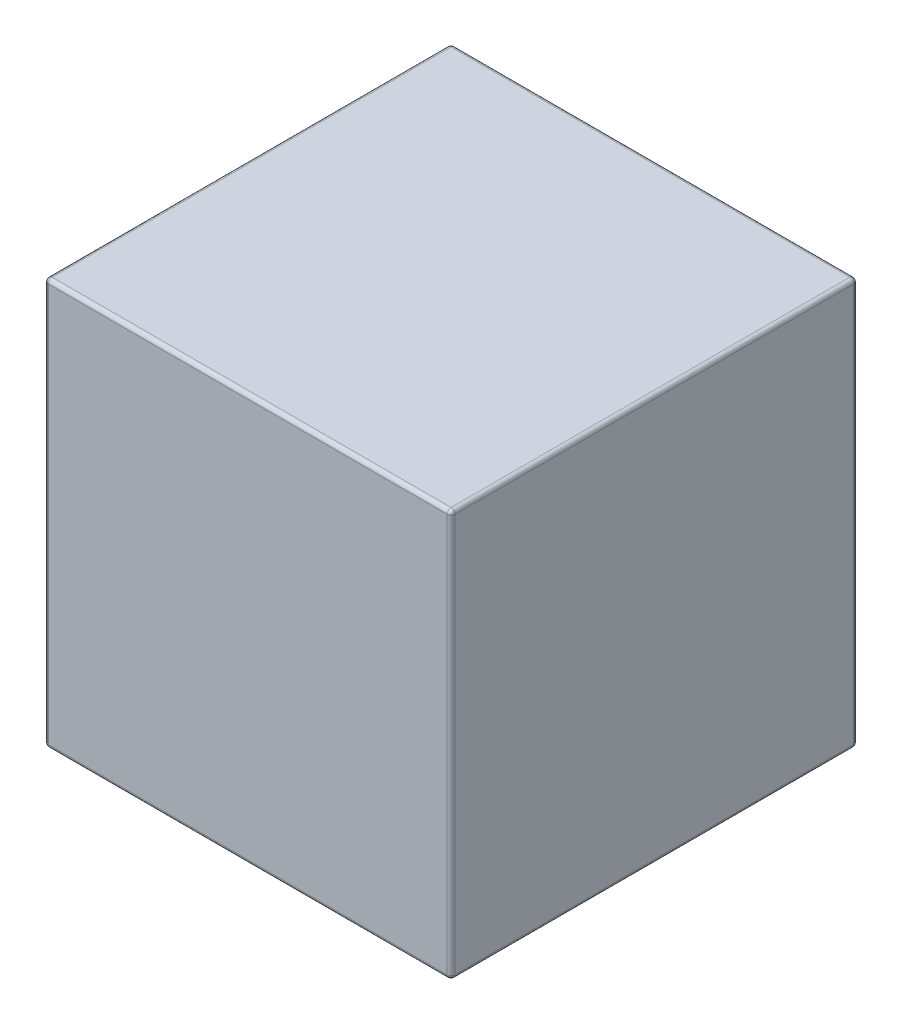
ISO-10303-21;
HEADER;
FILE_DESCRIPTION(('STEP AP214'),'2;1');
FILE_NAME('part.step','',(''),(''),'','','');
FILE_SCHEMA(('AUTOMOTIVE_DESIGN { 1 0 10303 214 1 1 1 1 }'));
ENDSEC;
DATA;
#1=APPLICATION_CONTEXT('core data for automotive mechanical design processes');
#2=APPLICATION_PROTOCOL_DEFINITION('international standard','automotive_design',2000,#1);
#3=PRODUCT_CONTEXT('',#1,'mechanical');
#4=PRODUCT('Part','Part','',(#3));
#5=PRODUCT_RELATED_PRODUCT_CATEGORY('part','',(#4));
#6=PRODUCT_DEFINITION_FORMATION('','',#4);
#7=PRODUCT_DEFINITION_CONTEXT('part definition',#1,'design');
#8=PRODUCT_DEFINITION('design','',#6,#7);
#9=PRODUCT_DEFINITION_SHAPE('','',#8);
#10=(LENGTH_UNIT() NAMED_UNIT(*) SI_UNIT(.MILLI.,.METRE.));
#11=(NAMED_UNIT(*) PLANE_ANGLE_UNIT() SI_UNIT($,.RADIAN.));
#12=(NAMED_UNIT(*) SI_UNIT($,.STERADIAN.) SOLID_ANGLE_UNIT());
#13=UNCERTAINTY_MEASURE_WITH_UNIT(LENGTH_MEASURE(1.E-05),#10,'distance_accuracy_value','');
#14=(GEOMETRIC_REPRESENTATION_CONTEXT(3) GLOBAL_UNCERTAINTY_ASSIGNED_CONTEXT((#13)) GLOBAL_UNIT_ASSIGNED_CONTEXT((#10,
#11,#12)) REPRESENTATION_CONTEXT('',''));
#15=CARTESIAN_POINT('',(0.,0.,0.));
#16=DIRECTION('',(0.,0.,1.));
#17=DIRECTION('',(1.,0.,0.));
#18=AXIS2_PLACEMENT_3D('',#15,#16,#17);
#19=CARTESIAN_POINT('',(-26.,-26.,52.));
#20=DIRECTION('',(1.,0.,0.));
#21=DIRECTION('',(0.,0.,-1.));
#22=AXIS2_PLACEMENT_3D('',#19,#20,#21);
#23=PLANE('',#22);
#24=DIRECTION('',(0.,-1.,0.));
#25=VECTOR('',#24,1.);
#26=CARTESIAN_POINT('',(-26.,26.,51.5));
#27=LINE('',#26,#25);
#28=CARTESIAN_POINT('',(-26.,-25.5,51.5));
#29=VERTEX_POINT('',#28);
#30=CARTESIAN_POINT('',(-26.,25.5,51.5));
#31=VERTEX_POINT('',#30);
#32=EDGE_CURVE('E161',#29,#31,#27,.F.);
#33=ORIENTED_EDGE('',*,*,#32,.T.);
#34=DIRECTION('',(0.,0.,-1.));
#35=VECTOR('',#34,1.);
#36=CARTESIAN_POINT('',(-26.,25.5,52.));
#37=LINE('',#36,#35);
#38=CARTESIAN_POINT('',(-26.,25.5,0.5));
#39=VERTEX_POINT('',#38);
#40=EDGE_CURVE('E132',#31,#39,#37,.T.);
#41=ORIENTED_EDGE('',*,*,#40,.T.);
#42=DIRECTION('',(0.,-1.,0.));
#43=VECTOR('',#42,1.);
#44=CARTESIAN_POINT('',(-26.,-26.,0.5));
#45=LINE('',#44,#43);
#46=CARTESIAN_POINT('',(-26.,-25.5,0.5));
#47=VERTEX_POINT('',#46);
#48=EDGE_CURVE('E151',#39,#47,#45,.T.);
#49=ORIENTED_EDGE('',*,*,#48,.T.);
#50=DIRECTION('',(0.,0.,-1.));
#51=VECTOR('',#50,1.);
#52=CARTESIAN_POINT('',(-26.,-25.5,52.));
#53=LINE('',#52,#51);
#54=EDGE_CURVE('E158',#47,#29,#53,.F.);
#55=ORIENTED_EDGE('',*,*,#54,.T.);
#56=EDGE_LOOP('',(#33,#41,#49,#55));
#57=FACE_BOUND('',#56,.T.);
#58=ADVANCED_FACE('F38',(#57),#23,.F.);
#59=CARTESIAN_POINT('',(26.,-26.,52.));
#60=DIRECTION('',(0.,1.,0.));
#61=DIRECTION('',(-1.,0.,0.));
#62=AXIS2_PLACEMENT_3D('',#59,#60,#61);
#63=PLANE('',#62);
#64=DIRECTION('',(1.,0.,0.));
#65=VECTOR('',#64,1.);
#66=CARTESIAN_POINT('',(-26.,-26.,51.5));
#67=LINE('',#66,#65);
#68=CARTESIAN_POINT('',(25.5,-26.,51.5));
#69=VERTEX_POINT('',#68);
#70=CARTESIAN_POINT('',(-25.5,-26.,51.5));
#71=VERTEX_POINT('',#70);
#72=EDGE_CURVE('E199',#69,#71,#67,.F.);
#73=ORIENTED_EDGE('',*,*,#72,.T.);
#74=DIRECTION('',(0.,0.,-1.));
#75=VECTOR('',#74,1.);
#76=CARTESIAN_POINT('',(-25.5,-26.,52.));
#77=LINE('',#76,#75);
#78=CARTESIAN_POINT('',(-25.5,-26.,0.5));
#79=VERTEX_POINT('',#78);
#80=EDGE_CURVE('E202',#71,#79,#77,.T.);
#81=ORIENTED_EDGE('',*,*,#80,.T.);
#82=DIRECTION('',(1.,0.,0.));
#83=VECTOR('',#82,1.);
#84=CARTESIAN_POINT('',(26.,-26.,0.5));
#85=LINE('',#84,#83);
#86=CARTESIAN_POINT('',(25.5,-26.,0.5));
#87=VERTEX_POINT('',#86);
#88=EDGE_CURVE('E196',#79,#87,#85,.T.);
#89=ORIENTED_EDGE('',*,*,#88,.T.);
#90=DIRECTION('',(0.,0.,-1.));
#91=VECTOR('',#90,1.);
#92=CARTESIAN_POINT('',(25.5,-26.,52.));
#93=LINE('',#92,#91);
#94=EDGE_CURVE('E193',#87,#69,#93,.F.);
#95=ORIENTED_EDGE('',*,*,#94,.T.);
#96=EDGE_LOOP('',(#73,#81,#89,#95));
#97=FACE_BOUND('',#96,.T.);
#98=ADVANCED_FACE('F329',(#97),#63,.F.);
#99=CARTESIAN_POINT('',(26.,-26.,52.));
#100=DIRECTION('',(-1.,0.,0.));
#101=DIRECTION('',(0.,0.,1.));
#102=AXIS2_PLACEMENT_3D('',#99,#100,#101);
#103=PLANE('',#102);
#104=DIRECTION('',(0.,1.,0.));
#105=VECTOR('',#104,1.);
#106=CARTESIAN_POINT('',(26.,-26.,51.5));
#107=LINE('',#106,#105);
#108=CARTESIAN_POINT('',(26.,25.5,51.5));
#109=VERTEX_POINT('',#108);
#110=CARTESIAN_POINT('',(26.,-25.5,51.5));
#111=VERTEX_POINT('',#110);
#112=EDGE_CURVE('E48',#109,#111,#107,.F.);
#113=ORIENTED_EDGE('',*,*,#112,.T.);
#114=DIRECTION('',(0.,0.,-1.));
#115=VECTOR('',#114,1.);
#116=CARTESIAN_POINT('',(26.,-25.5,52.));
#117=LINE('',#116,#115);
#118=CARTESIAN_POINT('',(26.,-25.5,0.5));
#119=VERTEX_POINT('',#118);
#120=EDGE_CURVE('E11',#111,#119,#117,.T.);
#121=ORIENTED_EDGE('',*,*,#120,.T.);
#122=DIRECTION('',(0.,1.,0.));
#123=VECTOR('',#122,1.);
#124=CARTESIAN_POINT('',(26.,-26.,0.5));
#125=LINE('',#124,#123);
#126=CARTESIAN_POINT('',(26.,25.5,0.5));
#127=VERTEX_POINT('',#126);
#128=EDGE_CURVE('E219',#119,#127,#125,.T.);
#129=ORIENTED_EDGE('',*,*,#128,.T.);
#130=DIRECTION('',(0.,0.,-1.));
#131=VECTOR('',#130,1.);
#132=CARTESIAN_POINT('',(26.,25.5,52.));
#133=LINE('',#132,#131);
#134=EDGE_CURVE('E59',#127,#109,#133,.F.);
#135=ORIENTED_EDGE('',*,*,#134,.T.);
#136=EDGE_LOOP('',(#113,#121,#129,#135));
#137=FACE_BOUND('',#136,.T.);
#138=ADVANCED_FACE('F341',(#137),#103,.F.);
#139=CARTESIAN_POINT('',(26.,26.,52.));
#140=DIRECTION('',(0.,-1.,0.));
#141=DIRECTION('',(1.,0.,0.));
#142=AXIS2_PLACEMENT_3D('',#139,#140,#141);
#143=PLANE('',#142);
#144=DIRECTION('',(-1.,0.,0.));
#145=VECTOR('',#144,1.);
#146=CARTESIAN_POINT('',(26.,26.,0.5));
#147=LINE('',#146,#145);
#148=CARTESIAN_POINT('',(25.5,26.,0.5));
#149=VERTEX_POINT('',#148);
#150=CARTESIAN_POINT('',(-25.5,26.,0.5));
#151=VERTEX_POINT('',#150);
#152=EDGE_CURVE('E168',#149,#151,#147,.T.);
#153=ORIENTED_EDGE('',*,*,#152,.T.);
#154=DIRECTION('',(0.,0.,-1.));
#155=VECTOR('',#154,1.);
#156=CARTESIAN_POINT('',(-25.5,26.,52.));
#157=LINE('',#156,#155);
#158=CARTESIAN_POINT('',(-25.5,26.,51.5));
#159=VERTEX_POINT('',#158);
#160=EDGE_CURVE('E134',#151,#159,#157,.F.);
#161=ORIENTED_EDGE('',*,*,#160,.T.);
#162=DIRECTION('',(-1.,0.,0.));
#163=VECTOR('',#162,1.);
#164=CARTESIAN_POINT('',(26.,26.,51.5));
#165=LINE('',#164,#163);
#166=CARTESIAN_POINT('',(25.5,26.,51.5));
#167=VERTEX_POINT('',#166);
#168=EDGE_CURVE('E175',#159,#167,#165,.F.);
#169=ORIENTED_EDGE('',*,*,#168,.T.);
#170=DIRECTION('',(0.,0.,-1.));
#171=VECTOR('',#170,1.);
#172=CARTESIAN_POINT('',(25.5,26.,52.));
#173=LINE('',#172,#171);
#174=EDGE_CURVE('E164',#167,#149,#173,.T.);
#175=ORIENTED_EDGE('',*,*,#174,.T.);
#176=EDGE_LOOP('',(#153,#161,#169,#175));
#177=FACE_BOUND('',#176,.T.);
#178=ADVANCED_FACE('F358',(#177),#143,.F.);
#179=CARTESIAN_POINT('',(0.,0.,52.));
#180=DIRECTION('',(0.,0.,1.));
#181=DIRECTION('',(1.,0.,0.));
#182=AXIS2_PLACEMENT_3D('',#179,#180,#181);
#183=PLANE('',#182);
#184=DIRECTION('',(0.,1.,0.));
#185=VECTOR('',#184,1.);
#186=CARTESIAN_POINT('',(25.5,26.,52.));
#187=LINE('',#186,#185);
#188=CARTESIAN_POINT('',(25.5,-25.5,52.));
#189=VERTEX_POINT('',#188);
#190=CARTESIAN_POINT('',(25.5,25.5,52.));
#191=VERTEX_POINT('',#190);
#192=EDGE_CURVE('E180',#189,#191,#187,.T.);
#193=ORIENTED_EDGE('',*,*,#192,.T.);
#194=DIRECTION('',(-1.,0.,0.));
#195=VECTOR('',#194,1.);
#196=CARTESIAN_POINT('',(-26.,25.5,52.));
#197=LINE('',#196,#195);
#198=CARTESIAN_POINT('',(-25.5,25.5,52.));
#199=VERTEX_POINT('',#198);
#200=EDGE_CURVE('E189',#191,#199,#197,.T.);
#201=ORIENTED_EDGE('',*,*,#200,.T.);
#202=DIRECTION('',(0.,-1.,0.));
#203=VECTOR('',#202,1.);
#204=CARTESIAN_POINT('',(-25.5,-26.,52.));
#205=LINE('',#204,#203);
#206=CARTESIAN_POINT('',(-25.5,-25.5,52.));
#207=VERTEX_POINT('',#206);
#208=EDGE_CURVE('E186',#199,#207,#205,.T.);
#209=ORIENTED_EDGE('',*,*,#208,.T.);
#210=DIRECTION('',(1.,0.,0.));
#211=VECTOR('',#210,1.);
#212=CARTESIAN_POINT('',(26.,-25.5,52.));
#213=LINE('',#212,#211);
#214=EDGE_CURVE('E183',#207,#189,#213,.T.);
#215=ORIENTED_EDGE('',*,*,#214,.T.);
#216=EDGE_LOOP('',(#193,#201,#209,#215));
#217=FACE_BOUND('',#216,.T.);
#218=ADVANCED_FACE('F320',(#217),#183,.T.);
#219=CARTESIAN_POINT('',(0.,0.,0.));
#220=DIRECTION('',(0.,0.,1.));
#221=DIRECTION('',(1.,0.,0.));
#222=AXIS2_PLACEMENT_3D('',#219,#220,#221);
#223=PLANE('',#222);
#224=DIRECTION('',(1.,0.,0.));
#225=VECTOR('',#224,1.);
#226=CARTESIAN_POINT('',(0.,-25.5,0.));
#227=LINE('',#226,#225);
#228=CARTESIAN_POINT('',(25.5,-25.5,0.));
#229=VERTEX_POINT('',#228);
#230=CARTESIAN_POINT('',(-25.5,-25.5,0.));
#231=VERTEX_POINT('',#230);
#232=EDGE_CURVE('E212',#229,#231,#227,.F.);
#233=ORIENTED_EDGE('',*,*,#232,.T.);
#234=DIRECTION('',(0.,-1.,0.));
#235=VECTOR('',#234,1.);
#236=CARTESIAN_POINT('',(-25.5,0.,0.));
#237=LINE('',#236,#235);
#238=CARTESIAN_POINT('',(-25.5,25.5,0.));
#239=VERTEX_POINT('',#238);
#240=EDGE_CURVE('E216',#231,#239,#237,.F.);
#241=ORIENTED_EDGE('',*,*,#240,.T.);
#242=DIRECTION('',(-1.,0.,0.));
#243=VECTOR('',#242,1.);
#244=CARTESIAN_POINT('',(0.,25.5,0.));
#245=LINE('',#244,#243);
#246=CARTESIAN_POINT('',(25.5,25.5,0.));
#247=VERTEX_POINT('',#246);
#248=EDGE_CURVE('E209',#239,#247,#245,.F.);
#249=ORIENTED_EDGE('',*,*,#248,.T.);
#250=DIRECTION('',(0.,1.,0.));
#251=VECTOR('',#250,1.);
#252=CARTESIAN_POINT('',(25.5,0.,0.));
#253=LINE('',#252,#251);
#254=EDGE_CURVE('E206',#247,#229,#253,.F.);
#255=ORIENTED_EDGE('',*,*,#254,.T.);
#256=EDGE_LOOP('',(#233,#241,#249,#255));
#257=FACE_BOUND('',#256,.T.);
#258=ADVANCED_FACE('F529',(#257),#223,.F.);
#259=CARTESIAN_POINT('',(25.5,-25.5,52.));
#260=DIRECTION('',(0.,0.,-1.));
#261=DIRECTION('',(-1.,0.,0.));
#262=AXIS2_PLACEMENT_3D('',#259,#260,#261);
#263=CYLINDRICAL_SURFACE('',#262,0.5);
#264=CARTESIAN_POINT('',(25.5,-25.5,51.5));
#265=DIRECTION('',(0.,0.,1.));
#266=DIRECTION('',(1.,0.,0.));
#267=AXIS2_PLACEMENT_3D('',#264,#265,#266);
#268=CIRCLE('',#267,0.5);
#269=EDGE_CURVE('E42',#69,#111,#268,.T.);
#270=ORIENTED_EDGE('',*,*,#269,.F.);
#271=ORIENTED_EDGE('',*,*,#94,.F.);
#272=CARTESIAN_POINT('',(25.5,-25.5,0.5));
#273=DIRECTION('',(0.,0.,-1.));
#274=DIRECTION('',(-1.,0.,0.));
#275=AXIS2_PLACEMENT_3D('',#272,#273,#274);
#276=CIRCLE('',#275,0.5);
#277=EDGE_CURVE('E296',#119,#87,#276,.T.);
#278=ORIENTED_EDGE('',*,*,#277,.F.);
#279=ORIENTED_EDGE('',*,*,#120,.F.);
#280=EDGE_LOOP('',(#270,#271,#278,#279));
#281=FACE_BOUND('',#280,.T.);
#282=ADVANCED_FACE('F40',(#281),#263,.T.);
#283=CARTESIAN_POINT('',(25.5,-25.5,51.5));
#284=DIRECTION('',(0.,0.,1.));
#285=DIRECTION('',(1.,0.,0.));
#286=AXIS2_PLACEMENT_3D('',#283,#284,#285);
#287=SPHERICAL_SURFACE('',#286,0.5);
#288=CARTESIAN_POINT('',(25.5,-25.5,51.5));
#289=DIRECTION('',(1.,0.,0.));
#290=DIRECTION('',(0.,0.,-1.));
#291=AXIS2_PLACEMENT_3D('',#288,#289,#290);
#292=CIRCLE('',#291,0.5);
#293=EDGE_CURVE('E289',#69,#189,#292,.F.);
#294=ORIENTED_EDGE('',*,*,#293,.F.);
#295=ORIENTED_EDGE('',*,*,#269,.T.);
#296=CARTESIAN_POINT('',(25.5,-25.5,51.5));
#297=DIRECTION('',(0.,-1.,0.));
#298=DIRECTION('',(0.,0.,-1.));
#299=AXIS2_PLACEMENT_3D('',#296,#297,#298);
#300=CIRCLE('',#299,0.5);
#301=EDGE_CURVE('E293',#189,#111,#300,.F.);
#302=ORIENTED_EDGE('',*,*,#301,.F.);
#303=EDGE_LOOP('',(#294,#295,#302));
#304=FACE_BOUND('',#303,.T.);
#305=ADVANCED_FACE('F309',(#304),#287,.T.);
#306=CARTESIAN_POINT('',(25.5,-25.5,0.5));
#307=DIRECTION('',(0.,0.,1.));
#308=DIRECTION('',(1.,0.,0.));
#309=AXIS2_PLACEMENT_3D('',#306,#307,#308);
#310=SPHERICAL_SURFACE('',#309,0.5);
#311=CARTESIAN_POINT('',(25.5,-25.5,0.5));
#312=DIRECTION('',(0.,-1.,0.));
#313=DIRECTION('',(0.,0.,-1.));
#314=AXIS2_PLACEMENT_3D('',#311,#312,#313);
#315=CIRCLE('',#314,0.5);
#316=EDGE_CURVE('E281',#119,#229,#315,.F.);
#317=ORIENTED_EDGE('',*,*,#316,.F.);
#318=ORIENTED_EDGE('',*,*,#277,.T.);
#319=CARTESIAN_POINT('',(25.5,-25.5,0.5));
#320=DIRECTION('',(1.,0.,0.));
#321=DIRECTION('',(0.,0.,-1.));
#322=AXIS2_PLACEMENT_3D('',#319,#320,#321);
#323=CIRCLE('',#322,0.5);
#324=EDGE_CURVE('E285',#229,#87,#323,.F.);
#325=ORIENTED_EDGE('',*,*,#324,.F.);
#326=EDGE_LOOP('',(#317,#318,#325));
#327=FACE_BOUND('',#326,.T.);
#328=ADVANCED_FACE('F508',(#327),#310,.T.);
#329=CARTESIAN_POINT('',(25.5,0.,51.5));
#330=DIRECTION('',(0.,-1.,0.));
#331=DIRECTION('',(0.,0.,-1.));
#332=AXIS2_PLACEMENT_3D('',#329,#330,#331);
#333=CYLINDRICAL_SURFACE('',#332,0.5);
#334=ORIENTED_EDGE('',*,*,#301,.T.);
#335=ORIENTED_EDGE('',*,*,#112,.F.);
#336=CARTESIAN_POINT('',(25.5,25.5,51.5));
#337=DIRECTION('',(0.,1.,0.));
#338=DIRECTION('',(0.,0.,1.));
#339=AXIS2_PLACEMENT_3D('',#336,#337,#338);
#340=CIRCLE('',#339,0.5);
#341=EDGE_CURVE('E273',#191,#109,#340,.T.);
#342=ORIENTED_EDGE('',*,*,#341,.F.);
#343=ORIENTED_EDGE('',*,*,#192,.F.);
#344=EDGE_LOOP('',(#334,#335,#342,#343));
#345=FACE_BOUND('',#344,.T.);
#346=ADVANCED_FACE('F315',(#345),#333,.T.);
#347=CARTESIAN_POINT('',(0.,-25.5,51.5));
#348=DIRECTION('',(-1.,0.,0.));
#349=DIRECTION('',(0.,-1.,0.));
#350=AXIS2_PLACEMENT_3D('',#347,#348,#349);
#351=CYLINDRICAL_SURFACE('',#350,0.5);
#352=ORIENTED_EDGE('',*,*,#293,.T.);
#353=ORIENTED_EDGE('',*,*,#214,.F.);
#354=CARTESIAN_POINT('',(-25.5,-25.5,51.5));
#355=DIRECTION('',(-1.,0.,0.));
#356=DIRECTION('',(0.,0.,1.));
#357=AXIS2_PLACEMENT_3D('',#354,#355,#356);
#358=CIRCLE('',#357,0.5);
#359=EDGE_CURVE('E269',#71,#207,#358,.T.);
#360=ORIENTED_EDGE('',*,*,#359,.F.);
#361=ORIENTED_EDGE('',*,*,#72,.F.);
#362=EDGE_LOOP('',(#352,#353,#360,#361));
#363=FACE_BOUND('',#362,.T.);
#364=ADVANCED_FACE('F326',(#363),#351,.T.);
#365=CARTESIAN_POINT('',(-25.5,-25.5,52.));
#366=DIRECTION('',(0.,0.,-1.));
#367=DIRECTION('',(-1.,0.,0.));
#368=AXIS2_PLACEMENT_3D('',#365,#366,#367);
#369=CYLINDRICAL_SURFACE('',#368,0.5);
#370=CARTESIAN_POINT('',(-25.5,-25.5,0.5));
#371=DIRECTION('',(0.,0.,-1.));
#372=DIRECTION('',(-1.,0.,0.));
#373=AXIS2_PLACEMENT_3D('',#370,#371,#372);
#374=CIRCLE('',#373,0.5);
#375=EDGE_CURVE('E261',#79,#47,#374,.T.);
#376=ORIENTED_EDGE('',*,*,#375,.F.);
#377=ORIENTED_EDGE('',*,*,#80,.F.);
#378=CARTESIAN_POINT('',(-25.5,-25.5,51.5));
#379=DIRECTION('',(0.,0.,1.));
#380=DIRECTION('',(1.,0.,0.));
#381=AXIS2_PLACEMENT_3D('',#378,#379,#380);
#382=CIRCLE('',#381,0.5);
#383=EDGE_CURVE('E265',#29,#71,#382,.T.);
#384=ORIENTED_EDGE('',*,*,#383,.F.);
#385=ORIENTED_EDGE('',*,*,#54,.F.);
#386=EDGE_LOOP('',(#376,#377,#384,#385));
#387=FACE_BOUND('',#386,.T.);
#388=ADVANCED_FACE('F333',(#387),#369,.T.);
#389=CARTESIAN_POINT('',(26.,-25.5,0.5));
#390=DIRECTION('',(1.,0.,0.));
#391=DIRECTION('',(0.,1.,0.));
#392=AXIS2_PLACEMENT_3D('',#389,#390,#391);
#393=CYLINDRICAL_SURFACE('',#392,0.5);
#394=ORIENTED_EDGE('',*,*,#324,.T.);
#395=ORIENTED_EDGE('',*,*,#88,.F.);
#396=CARTESIAN_POINT('',(-25.5,-25.5,0.5));
#397=DIRECTION('',(-1.,0.,0.));
#398=DIRECTION('',(0.,0.,1.));
#399=AXIS2_PLACEMENT_3D('',#396,#397,#398);
#400=CIRCLE('',#399,0.5);
#401=EDGE_CURVE('E258',#231,#79,#400,.T.);
#402=ORIENTED_EDGE('',*,*,#401,.F.);
#403=ORIENTED_EDGE('',*,*,#232,.F.);
#404=EDGE_LOOP('',(#394,#395,#402,#403));
#405=FACE_BOUND('',#404,.T.);
#406=ADVANCED_FACE('F339',(#405),#393,.T.);
#407=CARTESIAN_POINT('',(25.5,-26.,0.5));
#408=DIRECTION('',(0.,1.,0.));
#409=DIRECTION('',(0.,0.,1.));
#410=AXIS2_PLACEMENT_3D('',#407,#408,#409);
#411=CYLINDRICAL_SURFACE('',#410,0.5);
#412=ORIENTED_EDGE('',*,*,#316,.T.);
#413=ORIENTED_EDGE('',*,*,#254,.F.);
#414=CARTESIAN_POINT('',(25.5,25.5,0.5));
#415=DIRECTION('',(0.,1.,0.));
#416=DIRECTION('',(0.,0.,1.));
#417=AXIS2_PLACEMENT_3D('',#414,#415,#416);
#418=CIRCLE('',#417,0.5);
#419=EDGE_CURVE('E254',#127,#247,#418,.T.);
#420=ORIENTED_EDGE('',*,*,#419,.F.);
#421=ORIENTED_EDGE('',*,*,#128,.F.);
#422=EDGE_LOOP('',(#412,#413,#420,#421));
#423=FACE_BOUND('',#422,.T.);
#424=ADVANCED_FACE('F350',(#423),#411,.T.);
#425=CARTESIAN_POINT('',(25.5,25.5,52.));
#426=DIRECTION('',(0.,0.,-1.));
#427=DIRECTION('',(-1.,0.,0.));
#428=AXIS2_PLACEMENT_3D('',#425,#426,#427);
#429=CYLINDRICAL_SURFACE('',#428,0.5);
#430=CARTESIAN_POINT('',(25.5,25.5,51.5));
#431=DIRECTION('',(0.,0.,1.));
#432=DIRECTION('',(1.,0.,0.));
#433=AXIS2_PLACEMENT_3D('',#430,#431,#432);
#434=CIRCLE('',#433,0.5);
#435=EDGE_CURVE('E277',#109,#167,#434,.T.);
#436=ORIENTED_EDGE('',*,*,#435,.F.);
#437=ORIENTED_EDGE('',*,*,#134,.F.);
#438=CARTESIAN_POINT('',(25.5,25.5,0.5));
#439=DIRECTION('',(0.,0.,-1.));
#440=DIRECTION('',(-1.,0.,0.));
#441=AXIS2_PLACEMENT_3D('',#438,#439,#440);
#442=CIRCLE('',#441,0.5);
#443=EDGE_CURVE('E250',#149,#127,#442,.T.);
#444=ORIENTED_EDGE('',*,*,#443,.F.);
#445=ORIENTED_EDGE('',*,*,#174,.F.);
#446=EDGE_LOOP('',(#436,#437,#444,#445));
#447=FACE_BOUND('',#446,.T.);
#448=ADVANCED_FACE('F346',(#447),#429,.T.);
#449=CARTESIAN_POINT('',(25.5,25.5,51.5));
#450=DIRECTION('',(0.,0.,1.));
#451=DIRECTION('',(1.,0.,0.));
#452=AXIS2_PLACEMENT_3D('',#449,#450,#451);
#453=SPHERICAL_SURFACE('',#452,0.5);
#454=ORIENTED_EDGE('',*,*,#341,.T.);
#455=ORIENTED_EDGE('',*,*,#435,.T.);
#456=CARTESIAN_POINT('',(25.5,25.5,51.5));
#457=DIRECTION('',(1.,0.,0.));
#458=DIRECTION('',(0.,0.,-1.));
#459=AXIS2_PLACEMENT_3D('',#456,#457,#458);
#460=CIRCLE('',#459,0.5);
#461=EDGE_CURVE('E246',#191,#167,#460,.F.);
#462=ORIENTED_EDGE('',*,*,#461,.F.);
#463=EDGE_LOOP('',(#454,#455,#462));
#464=FACE_BOUND('',#463,.T.);
#465=ADVANCED_FACE('F361',(#464),#453,.T.);
#466=CARTESIAN_POINT('',(-25.5,-25.5,51.5));
#467=DIRECTION('',(0.,0.,1.));
#468=DIRECTION('',(1.,0.,0.));
#469=AXIS2_PLACEMENT_3D('',#466,#467,#468);
#470=SPHERICAL_SURFACE('',#469,0.5);
#471=ORIENTED_EDGE('',*,*,#383,.T.);
#472=ORIENTED_EDGE('',*,*,#359,.T.);
#473=CARTESIAN_POINT('',(-25.5,-25.5,51.5));
#474=DIRECTION('',(0.,-1.,0.));
#475=DIRECTION('',(0.,0.,-1.));
#476=AXIS2_PLACEMENT_3D('',#473,#474,#475);
#477=CIRCLE('',#476,0.5);
#478=EDGE_CURVE('E242',#29,#207,#477,.F.);
#479=ORIENTED_EDGE('',*,*,#478,.F.);
#480=EDGE_LOOP('',(#471,#472,#479));
#481=FACE_BOUND('',#480,.T.);
#482=ADVANCED_FACE('F370',(#481),#470,.T.);
#483=CARTESIAN_POINT('',(-25.5,-25.5,0.5));
#484=DIRECTION('',(0.,0.,1.));
#485=DIRECTION('',(1.,0.,0.));
#486=AXIS2_PLACEMENT_3D('',#483,#484,#485);
#487=SPHERICAL_SURFACE('',#486,0.5);
#488=ORIENTED_EDGE('',*,*,#401,.T.);
#489=ORIENTED_EDGE('',*,*,#375,.T.);
#490=CARTESIAN_POINT('',(-25.5,-25.5,0.5));
#491=DIRECTION('',(0.,-1.,0.));
#492=DIRECTION('',(0.,0.,-1.));
#493=AXIS2_PLACEMENT_3D('',#490,#491,#492);
#494=CIRCLE('',#493,0.5);
#495=EDGE_CURVE('E154',#231,#47,#494,.F.);
#496=ORIENTED_EDGE('',*,*,#495,.F.);
#497=EDGE_LOOP('',(#488,#489,#496));
#498=FACE_BOUND('',#497,.T.);
#499=ADVANCED_FACE('F372',(#498),#487,.T.);
#500=CARTESIAN_POINT('',(25.5,25.5,0.5));
#501=DIRECTION('',(0.,0.,1.));
#502=DIRECTION('',(1.,0.,0.));
#503=AXIS2_PLACEMENT_3D('',#500,#501,#502);
#504=SPHERICAL_SURFACE('',#503,0.5);
#505=ORIENTED_EDGE('',*,*,#443,.T.);
#506=ORIENTED_EDGE('',*,*,#419,.T.);
#507=CARTESIAN_POINT('',(25.5,25.5,0.5));
#508=DIRECTION('',(1.,0.,0.));
#509=DIRECTION('',(0.,0.,-1.));
#510=AXIS2_PLACEMENT_3D('',#507,#508,#509);
#511=CIRCLE('',#510,0.5);
#512=EDGE_CURVE('E236',#149,#247,#511,.F.);
#513=ORIENTED_EDGE('',*,*,#512,.F.);
#514=EDGE_LOOP('',(#505,#506,#513));
#515=FACE_BOUND('',#514,.T.);
#516=ADVANCED_FACE('F352',(#515),#504,.T.);
#517=CARTESIAN_POINT('',(0.,25.5,51.5));
#518=DIRECTION('',(1.,0.,0.));
#519=DIRECTION('',(0.,1.,0.));
#520=AXIS2_PLACEMENT_3D('',#517,#518,#519);
#521=CYLINDRICAL_SURFACE('',#520,0.5);
#522=ORIENTED_EDGE('',*,*,#461,.T.);
#523=ORIENTED_EDGE('',*,*,#168,.F.);
#524=CARTESIAN_POINT('',(-25.5,25.5,51.5));
#525=DIRECTION('',(-1.,0.,0.));
#526=DIRECTION('',(0.,0.,1.));
#527=AXIS2_PLACEMENT_3D('',#524,#525,#526);
#528=CIRCLE('',#527,0.5);
#529=EDGE_CURVE('E232',#199,#159,#528,.T.);
#530=ORIENTED_EDGE('',*,*,#529,.F.);
#531=ORIENTED_EDGE('',*,*,#200,.F.);
#532=EDGE_LOOP('',(#522,#523,#530,#531));
#533=FACE_BOUND('',#532,.T.);
#534=ADVANCED_FACE('F363',(#533),#521,.T.);
#535=CARTESIAN_POINT('',(-25.5,0.,51.5));
#536=DIRECTION('',(0.,1.,0.));
#537=DIRECTION('',(0.,0.,1.));
#538=AXIS2_PLACEMENT_3D('',#535,#536,#537);
#539=CYLINDRICAL_SURFACE('',#538,0.5);
#540=ORIENTED_EDGE('',*,*,#478,.T.);
#541=ORIENTED_EDGE('',*,*,#208,.F.);
#542=CARTESIAN_POINT('',(-25.5,25.5,51.5));
#543=DIRECTION('',(0.,1.,0.));
#544=DIRECTION('',(0.,0.,1.));
#545=AXIS2_PLACEMENT_3D('',#542,#543,#544);
#546=CIRCLE('',#545,0.5);
#547=EDGE_CURVE('E148',#31,#199,#546,.T.);
#548=ORIENTED_EDGE('',*,*,#547,.F.);
#549=ORIENTED_EDGE('',*,*,#32,.F.);
#550=EDGE_LOOP('',(#540,#541,#548,#549));
#551=FACE_BOUND('',#550,.T.);
#552=ADVANCED_FACE('F368',(#551),#539,.T.);
#553=CARTESIAN_POINT('',(-25.5,-26.,0.5));
#554=DIRECTION('',(0.,-1.,0.));
#555=DIRECTION('',(0.,0.,-1.));
#556=AXIS2_PLACEMENT_3D('',#553,#554,#555);
#557=CYLINDRICAL_SURFACE('',#556,0.5);
#558=ORIENTED_EDGE('',*,*,#495,.T.);
#559=ORIENTED_EDGE('',*,*,#48,.F.);
#560=CARTESIAN_POINT('',(-25.5,25.5,0.5));
#561=DIRECTION('',(0.,1.,0.));
#562=DIRECTION('',(0.,0.,1.));
#563=AXIS2_PLACEMENT_3D('',#560,#561,#562);
#564=CIRCLE('',#563,0.5);
#565=EDGE_CURVE('E141',#239,#39,#564,.T.);
#566=ORIENTED_EDGE('',*,*,#565,.F.);
#567=ORIENTED_EDGE('',*,*,#240,.F.);
#568=EDGE_LOOP('',(#558,#559,#566,#567));
#569=FACE_BOUND('',#568,.T.);
#570=ADVANCED_FACE('F152',(#569),#557,.T.);
#571=CARTESIAN_POINT('',(26.,25.5,0.5));
#572=DIRECTION('',(-1.,0.,0.));
#573=DIRECTION('',(0.,-1.,0.));
#574=AXIS2_PLACEMENT_3D('',#571,#572,#573);
#575=CYLINDRICAL_SURFACE('',#574,0.5);
#576=ORIENTED_EDGE('',*,*,#512,.T.);
#577=ORIENTED_EDGE('',*,*,#248,.F.);
#578=CARTESIAN_POINT('',(-25.5,25.5,0.5));
#579=DIRECTION('',(-1.,0.,0.));
#580=DIRECTION('',(0.,0.,1.));
#581=AXIS2_PLACEMENT_3D('',#578,#579,#580);
#582=CIRCLE('',#581,0.5);
#583=EDGE_CURVE('E145',#151,#239,#582,.T.);
#584=ORIENTED_EDGE('',*,*,#583,.F.);
#585=ORIENTED_EDGE('',*,*,#152,.F.);
#586=EDGE_LOOP('',(#576,#577,#584,#585));
#587=FACE_BOUND('',#586,.T.);
#588=ADVANCED_FACE('F356',(#587),#575,.T.);
#589=CARTESIAN_POINT('',(-25.5,25.5,51.5));
#590=DIRECTION('',(0.,0.,1.));
#591=DIRECTION('',(1.,0.,0.));
#592=AXIS2_PLACEMENT_3D('',#589,#590,#591);
#593=SPHERICAL_SURFACE('',#592,0.5);
#594=ORIENTED_EDGE('',*,*,#547,.T.);
#595=ORIENTED_EDGE('',*,*,#529,.T.);
#596=CARTESIAN_POINT('',(-25.5,25.5,51.5));
#597=DIRECTION('',(0.,0.,1.));
#598=DIRECTION('',(1.,0.,0.));
#599=AXIS2_PLACEMENT_3D('',#596,#597,#598);
#600=CIRCLE('',#599,0.5);
#601=EDGE_CURVE('E138',#31,#159,#600,.F.);
#602=ORIENTED_EDGE('',*,*,#601,.F.);
#603=EDGE_LOOP('',(#594,#595,#602));
#604=FACE_BOUND('',#603,.T.);
#605=ADVANCED_FACE('F392',(#604),#593,.T.);
#606=CARTESIAN_POINT('',(-25.5,25.5,0.5));
#607=DIRECTION('',(0.,0.,1.));
#608=DIRECTION('',(1.,0.,0.));
#609=AXIS2_PLACEMENT_3D('',#606,#607,#608);
#610=SPHERICAL_SURFACE('',#609,0.5);
#611=ORIENTED_EDGE('',*,*,#583,.T.);
#612=ORIENTED_EDGE('',*,*,#565,.T.);
#613=CARTESIAN_POINT('',(-25.5,25.5,0.5));
#614=DIRECTION('',(0.,0.,-1.));
#615=DIRECTION('',(-1.,0.,0.));
#616=AXIS2_PLACEMENT_3D('',#613,#614,#615);
#617=CIRCLE('',#616,0.5);
#618=EDGE_CURVE('E128',#151,#39,#617,.F.);
#619=ORIENTED_EDGE('',*,*,#618,.F.);
#620=EDGE_LOOP('',(#611,#612,#619));
#621=FACE_BOUND('',#620,.T.);
#622=ADVANCED_FACE('F143',(#621),#610,.T.);
#623=CARTESIAN_POINT('',(-25.5,25.5,52.));
#624=DIRECTION('',(0.,0.,-1.));
#625=DIRECTION('',(-1.,0.,0.));
#626=AXIS2_PLACEMENT_3D('',#623,#624,#625);
#627=CYLINDRICAL_SURFACE('',#626,0.5);
#628=ORIENTED_EDGE('',*,*,#601,.T.);
#629=ORIENTED_EDGE('',*,*,#160,.F.);
#630=ORIENTED_EDGE('',*,*,#618,.T.);
#631=ORIENTED_EDGE('',*,*,#40,.F.);
#632=EDGE_LOOP('',(#628,#629,#630,#631));
#633=FACE_BOUND('',#632,.T.);
#634=ADVANCED_FACE('F130',(#633),#627,.T.);
#635=CLOSED_SHELL('',(#58,#98,#138,#178,#218,#258,#282,#305,#328,#346,#364,#388,#406,#424,#448,
#465,#482,#499,#516,#534,#552,#570,#588,#605,#622,#634));
#636=MANIFOLD_SOLID_BREP('B2',#635);
#637=ADVANCED_BREP_SHAPE_REPRESENTATION('',(#18,#636),#14);
#638=SHAPE_DEFINITION_REPRESENTATION(#9,#637);
ENDSEC;
END-ISO-10303-21;
